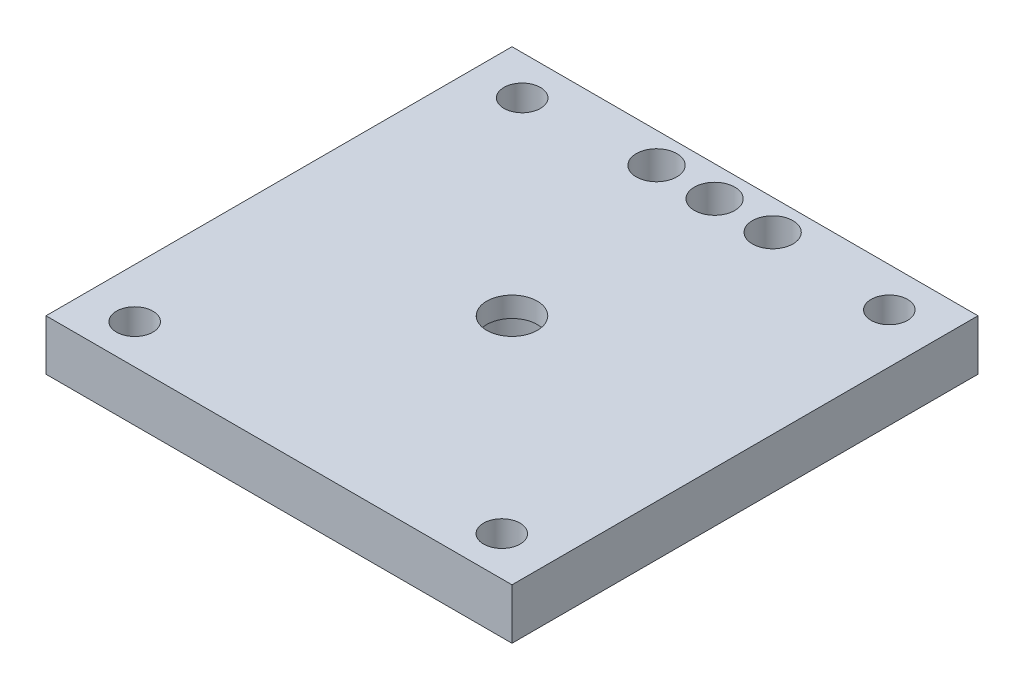
ISO-10303-21;
HEADER;
FILE_DESCRIPTION(('STEP AP214'),'2;1');
FILE_NAME('part.step','',(''),(''),'','','');
FILE_SCHEMA(('AUTOMOTIVE_DESIGN { 1 0 10303 214 1 1 1 1 }'));
ENDSEC;
DATA;
#1=APPLICATION_CONTEXT('core data for automotive mechanical design processes');
#2=APPLICATION_PROTOCOL_DEFINITION('international standard','automotive_design',2000,#1);
#3=PRODUCT_CONTEXT('',#1,'mechanical');
#4=PRODUCT('Part','Part','',(#3));
#5=PRODUCT_RELATED_PRODUCT_CATEGORY('part','',(#4));
#6=PRODUCT_DEFINITION_FORMATION('','',#4);
#7=PRODUCT_DEFINITION_CONTEXT('part definition',#1,'design');
#8=PRODUCT_DEFINITION('design','',#6,#7);
#9=PRODUCT_DEFINITION_SHAPE('','',#8);
#10=(LENGTH_UNIT() NAMED_UNIT(*) SI_UNIT(.MILLI.,.METRE.));
#11=(NAMED_UNIT(*) PLANE_ANGLE_UNIT() SI_UNIT($,.RADIAN.));
#12=(NAMED_UNIT(*) SI_UNIT($,.STERADIAN.) SOLID_ANGLE_UNIT());
#13=UNCERTAINTY_MEASURE_WITH_UNIT(LENGTH_MEASURE(1.E-05),#10,'distance_accuracy_value','');
#14=(GEOMETRIC_REPRESENTATION_CONTEXT(3) GLOBAL_UNCERTAINTY_ASSIGNED_CONTEXT((#13)) GLOBAL_UNIT_ASSIGNED_CONTEXT((#10,
#11,#12)) REPRESENTATION_CONTEXT('',''));
#15=CARTESIAN_POINT('',(0.,0.,0.));
#16=DIRECTION('',(0.,0.,1.));
#17=DIRECTION('',(1.,0.,0.));
#18=AXIS2_PLACEMENT_3D('',#15,#16,#17);
#19=CARTESIAN_POINT('',(23.,5.,-23.));
#20=DIRECTION('',(-1.,0.,0.));
#21=DIRECTION('',(0.,0.,1.));
#22=AXIS2_PLACEMENT_3D('',#19,#20,#21);
#23=PLANE('',#22);
#24=DIRECTION('',(0.,0.,-1.));
#25=VECTOR('',#24,1.);
#26=CARTESIAN_POINT('',(23.,0.,-23.));
#27=LINE('',#26,#25);
#28=CARTESIAN_POINT('',(23.,0.,23.));
#29=VERTEX_POINT('',#28);
#30=CARTESIAN_POINT('',(23.,0.,-23.));
#31=VERTEX_POINT('',#30);
#32=EDGE_CURVE('E227',#29,#31,#27,.T.);
#33=ORIENTED_EDGE('',*,*,#32,.T.);
#34=DIRECTION('',(0.,-1.,0.));
#35=VECTOR('',#34,1.);
#36=CARTESIAN_POINT('',(23.,5.,-23.));
#37=LINE('',#36,#35);
#38=CARTESIAN_POINT('',(23.,5.,-23.));
#39=VERTEX_POINT('',#38);
#40=EDGE_CURVE('E11',#39,#31,#37,.T.);
#41=ORIENTED_EDGE('',*,*,#40,.F.);
#42=DIRECTION('',(0.,0.,-1.));
#43=VECTOR('',#42,1.);
#44=CARTESIAN_POINT('',(23.,5.,-23.));
#45=LINE('',#44,#43);
#46=CARTESIAN_POINT('',(23.,5.,23.));
#47=VERTEX_POINT('',#46);
#48=EDGE_CURVE('E230',#47,#39,#45,.T.);
#49=ORIENTED_EDGE('',*,*,#48,.F.);
#50=DIRECTION('',(0.,-1.,0.));
#51=VECTOR('',#50,1.);
#52=CARTESIAN_POINT('',(23.,5.,23.));
#53=LINE('',#52,#51);
#54=EDGE_CURVE('E240',#47,#29,#53,.T.);
#55=ORIENTED_EDGE('',*,*,#54,.T.);
#56=EDGE_LOOP('',(#33,#41,#49,#55));
#57=FACE_BOUND('',#56,.T.);
#58=ADVANCED_FACE('F33',(#57),#23,.F.);
#59=CARTESIAN_POINT('',(-23.,5.,-23.));
#60=DIRECTION('',(0.,0.,1.));
#61=DIRECTION('',(1.,0.,0.));
#62=AXIS2_PLACEMENT_3D('',#59,#60,#61);
#63=PLANE('',#62);
#64=DIRECTION('',(-1.,0.,0.));
#65=VECTOR('',#64,1.);
#66=CARTESIAN_POINT('',(-23.,0.,-23.));
#67=LINE('',#66,#65);
#68=CARTESIAN_POINT('',(-23.,0.,-23.));
#69=VERTEX_POINT('',#68);
#70=EDGE_CURVE('E243',#31,#69,#67,.T.);
#71=ORIENTED_EDGE('',*,*,#70,.T.);
#72=DIRECTION('',(0.,-1.,0.));
#73=VECTOR('',#72,1.);
#74=CARTESIAN_POINT('',(-23.,5.,-23.));
#75=LINE('',#74,#73);
#76=CARTESIAN_POINT('',(-23.,5.,-23.));
#77=VERTEX_POINT('',#76);
#78=EDGE_CURVE('E41',#77,#69,#75,.T.);
#79=ORIENTED_EDGE('',*,*,#78,.F.);
#80=DIRECTION('',(-1.,0.,0.));
#81=VECTOR('',#80,1.);
#82=CARTESIAN_POINT('',(-23.,5.,-23.));
#83=LINE('',#82,#81);
#84=EDGE_CURVE('E233',#39,#77,#83,.T.);
#85=ORIENTED_EDGE('',*,*,#84,.F.);
#86=ORIENTED_EDGE('',*,*,#40,.T.);
#87=EDGE_LOOP('',(#71,#79,#85,#86));
#88=FACE_BOUND('',#87,.T.);
#89=ADVANCED_FACE('F274',(#88),#63,.F.);
#90=CARTESIAN_POINT('',(-23.,5.,-23.));
#91=DIRECTION('',(1.,0.,0.));
#92=DIRECTION('',(0.,0.,-1.));
#93=AXIS2_PLACEMENT_3D('',#90,#91,#92);
#94=PLANE('',#93);
#95=DIRECTION('',(0.,0.,1.));
#96=VECTOR('',#95,1.);
#97=CARTESIAN_POINT('',(-23.,0.,-23.));
#98=LINE('',#97,#96);
#99=CARTESIAN_POINT('',(-23.,0.,23.));
#100=VERTEX_POINT('',#99);
#101=EDGE_CURVE('E245',#69,#100,#98,.T.);
#102=ORIENTED_EDGE('',*,*,#101,.T.);
#103=DIRECTION('',(0.,-1.,0.));
#104=VECTOR('',#103,1.);
#105=CARTESIAN_POINT('',(-23.,5.,23.));
#106=LINE('',#105,#104);
#107=CARTESIAN_POINT('',(-23.,5.,23.));
#108=VERTEX_POINT('',#107);
#109=EDGE_CURVE('E250',#108,#100,#106,.T.);
#110=ORIENTED_EDGE('',*,*,#109,.F.);
#111=DIRECTION('',(0.,0.,1.));
#112=VECTOR('',#111,1.);
#113=CARTESIAN_POINT('',(-23.,5.,-23.));
#114=LINE('',#113,#112);
#115=EDGE_CURVE('E236',#77,#108,#114,.T.);
#116=ORIENTED_EDGE('',*,*,#115,.F.);
#117=ORIENTED_EDGE('',*,*,#78,.T.);
#118=EDGE_LOOP('',(#102,#110,#116,#117));
#119=FACE_BOUND('',#118,.T.);
#120=ADVANCED_FACE('F258',(#119),#94,.F.);
#121=CARTESIAN_POINT('',(-23.,5.,23.));
#122=DIRECTION('',(0.,0.,-1.));
#123=DIRECTION('',(-1.,0.,0.));
#124=AXIS2_PLACEMENT_3D('',#121,#122,#123);
#125=PLANE('',#124);
#126=DIRECTION('',(1.,0.,0.));
#127=VECTOR('',#126,1.);
#128=CARTESIAN_POINT('',(-23.,0.,23.));
#129=LINE('',#128,#127);
#130=EDGE_CURVE('E234',#100,#29,#129,.T.);
#131=ORIENTED_EDGE('',*,*,#130,.T.);
#132=ORIENTED_EDGE('',*,*,#54,.F.);
#133=DIRECTION('',(1.,0.,0.));
#134=VECTOR('',#133,1.);
#135=CARTESIAN_POINT('',(-23.,5.,23.));
#136=LINE('',#135,#134);
#137=EDGE_CURVE('E238',#108,#47,#136,.T.);
#138=ORIENTED_EDGE('',*,*,#137,.F.);
#139=ORIENTED_EDGE('',*,*,#109,.T.);
#140=EDGE_LOOP('',(#131,#132,#138,#139));
#141=FACE_BOUND('',#140,.T.);
#142=ADVANCED_FACE('F267',(#141),#125,.F.);
#143=CARTESIAN_POINT('',(0.,5.,0.));
#144=DIRECTION('',(0.,1.,0.));
#145=DIRECTION('',(0.,0.,1.));
#146=AXIS2_PLACEMENT_3D('',#143,#144,#145);
#147=PLANE('',#146);
#148=CARTESIAN_POINT('',(-5.733002600256,5.,-20.));
#149=DIRECTION('',(0.,1.,0.));
#150=DIRECTION('',(0.,0.,1.));
#151=AXIS2_PLACEMENT_3D('',#148,#149,#150);
#152=CIRCLE('',#151,2.);
#153=CARTESIAN_POINT('',(-5.733002600256,5.,-18.));
#154=VERTEX_POINT('',#153);
#155=EDGE_CURVE('E159',#154,#154,#152,.T.);
#156=ORIENTED_EDGE('',*,*,#155,.F.);
#157=EDGE_LOOP('',(#156));
#158=FACE_BOUND('',#157,.T.);
#159=CARTESIAN_POINT('',(5.73,5.,-20.));
#160=DIRECTION('',(0.,1.,0.));
#161=DIRECTION('',(0.,0.,1.));
#162=AXIS2_PLACEMENT_3D('',#159,#160,#161);
#163=CIRCLE('',#162,2.);
#164=CARTESIAN_POINT('',(5.73,5.,-18.));
#165=VERTEX_POINT('',#164);
#166=EDGE_CURVE('E369',#165,#165,#163,.T.);
#167=ORIENTED_EDGE('',*,*,#166,.F.);
#168=EDGE_LOOP('',(#167));
#169=FACE_BOUND('',#168,.T.);
#170=CARTESIAN_POINT('',(0.,5.,-20.));
#171=DIRECTION('',(0.,1.,0.));
#172=DIRECTION('',(0.,0.,1.));
#173=AXIS2_PLACEMENT_3D('',#170,#171,#172);
#174=CIRCLE('',#173,2.);
#175=CARTESIAN_POINT('',(0.,5.,-18.));
#176=VERTEX_POINT('',#175);
#177=EDGE_CURVE('E377',#176,#176,#174,.T.);
#178=ORIENTED_EDGE('',*,*,#177,.F.);
#179=EDGE_LOOP('',(#178));
#180=FACE_BOUND('',#179,.T.);
#181=CARTESIAN_POINT('',(0.,5.,0.));
#182=DIRECTION('',(0.,1.,0.));
#183=DIRECTION('',(0.,0.,1.));
#184=AXIS2_PLACEMENT_3D('',#181,#182,#183);
#185=CIRCLE('',#184,2.5);
#186=CARTESIAN_POINT('',(0.,5.,2.5));
#187=VERTEX_POINT('',#186);
#188=EDGE_CURVE('E221',#187,#187,#185,.T.);
#189=ORIENTED_EDGE('',*,*,#188,.F.);
#190=EDGE_LOOP('',(#189));
#191=FACE_BOUND('',#190,.T.);
#192=CARTESIAN_POINT('',(-18.12,5.,19.125));
#193=DIRECTION('',(0.,1.,0.));
#194=DIRECTION('',(0.,0.,1.));
#195=AXIS2_PLACEMENT_3D('',#192,#193,#194);
#196=CIRCLE('',#195,1.8);
#197=CARTESIAN_POINT('',(-18.12,5.,20.925));
#198=VERTEX_POINT('',#197);
#199=EDGE_CURVE('E215',#198,#198,#196,.T.);
#200=ORIENTED_EDGE('',*,*,#199,.F.);
#201=EDGE_LOOP('',(#200));
#202=FACE_BOUND('',#201,.T.);
#203=CARTESIAN_POINT('',(18.12,5.,19.125));
#204=DIRECTION('',(0.,1.,0.));
#205=DIRECTION('',(0.,0.,1.));
#206=AXIS2_PLACEMENT_3D('',#203,#204,#205);
#207=CIRCLE('',#206,1.8);
#208=CARTESIAN_POINT('',(18.12,5.,20.925));
#209=VERTEX_POINT('',#208);
#210=EDGE_CURVE('E209',#209,#209,#207,.T.);
#211=ORIENTED_EDGE('',*,*,#210,.F.);
#212=EDGE_LOOP('',(#211));
#213=FACE_BOUND('',#212,.T.);
#214=CARTESIAN_POINT('',(18.12,5.,-19.125));
#215=DIRECTION('',(0.,1.,0.));
#216=DIRECTION('',(0.,0.,1.));
#217=AXIS2_PLACEMENT_3D('',#214,#215,#216);
#218=CIRCLE('',#217,1.8);
#219=CARTESIAN_POINT('',(18.12,5.,-17.325));
#220=VERTEX_POINT('',#219);
#221=EDGE_CURVE('E202',#220,#220,#218,.T.);
#222=ORIENTED_EDGE('',*,*,#221,.F.);
#223=EDGE_LOOP('',(#222));
#224=FACE_BOUND('',#223,.T.);
#225=CARTESIAN_POINT('',(-18.12,5.,-19.125));
#226=DIRECTION('',(0.,1.,0.));
#227=DIRECTION('',(0.,0.,1.));
#228=AXIS2_PLACEMENT_3D('',#225,#226,#227);
#229=CIRCLE('',#228,1.8);
#230=CARTESIAN_POINT('',(-18.12,5.,-17.325));
#231=VERTEX_POINT('',#230);
#232=EDGE_CURVE('E224',#231,#231,#229,.T.);
#233=ORIENTED_EDGE('',*,*,#232,.F.);
#234=EDGE_LOOP('',(#233));
#235=FACE_BOUND('',#234,.T.);
#236=ORIENTED_EDGE('',*,*,#48,.T.);
#237=ORIENTED_EDGE('',*,*,#84,.T.);
#238=ORIENTED_EDGE('',*,*,#115,.T.);
#239=ORIENTED_EDGE('',*,*,#137,.T.);
#240=EDGE_LOOP('',(#236,#237,#238,#239));
#241=FACE_BOUND('',#240,.T.);
#242=ADVANCED_FACE('F273',(#158,#169,#180,#191,#202,#213,#224,#235,#241),#147,.T.);
#243=CARTESIAN_POINT('',(0.,0.,0.));
#244=DIRECTION('',(0.,1.,0.));
#245=DIRECTION('',(0.,0.,1.));
#246=AXIS2_PLACEMENT_3D('',#243,#244,#245);
#247=PLANE('',#246);
#248=CARTESIAN_POINT('',(-5.733002600256,0.,-20.));
#249=DIRECTION('',(0.,1.,0.));
#250=DIRECTION('',(0.,0.,1.));
#251=AXIS2_PLACEMENT_3D('',#248,#249,#250);
#252=CIRCLE('',#251,2.);
#253=CARTESIAN_POINT('',(-5.733002600256,0.,-18.));
#254=VERTEX_POINT('',#253);
#255=EDGE_CURVE('E368',#254,#254,#252,.T.);
#256=ORIENTED_EDGE('',*,*,#255,.T.);
#257=EDGE_LOOP('',(#256));
#258=FACE_BOUND('',#257,.T.);
#259=CARTESIAN_POINT('',(5.73,0.,-20.));
#260=DIRECTION('',(0.,1.,0.));
#261=DIRECTION('',(0.,0.,1.));
#262=AXIS2_PLACEMENT_3D('',#259,#260,#261);
#263=CIRCLE('',#262,2.);
#264=CARTESIAN_POINT('',(5.73,0.,-18.));
#265=VERTEX_POINT('',#264);
#266=EDGE_CURVE('E373',#265,#265,#263,.T.);
#267=ORIENTED_EDGE('',*,*,#266,.T.);
#268=EDGE_LOOP('',(#267));
#269=FACE_BOUND('',#268,.T.);
#270=CARTESIAN_POINT('',(0.,0.,-20.));
#271=DIRECTION('',(0.,1.,0.));
#272=DIRECTION('',(0.,0.,1.));
#273=AXIS2_PLACEMENT_3D('',#270,#271,#272);
#274=CIRCLE('',#273,2.);
#275=CARTESIAN_POINT('',(0.,0.,-18.));
#276=VERTEX_POINT('',#275);
#277=EDGE_CURVE('E152',#276,#276,#274,.T.);
#278=ORIENTED_EDGE('',*,*,#277,.T.);
#279=EDGE_LOOP('',(#278));
#280=FACE_BOUND('',#279,.T.);
#281=DIRECTION('',(1.,0.,0.));
#282=VECTOR('',#281,1.);
#283=CARTESIAN_POINT('',(3.86237656280875,0.,6.93972722617175));
#284=LINE('',#283,#282);
#285=CARTESIAN_POINT('',(3.86237656280875,0.,6.93972722617175));
#286=VERTEX_POINT('',#285);
#287=CARTESIAN_POINT('',(7.86237656280875,0.,6.93972722617175));
#288=VERTEX_POINT('',#287);
#289=EDGE_CURVE('E147',#286,#288,#284,.T.);
#290=ORIENTED_EDGE('',*,*,#289,.T.);
#291=DIRECTION('',(0.,0.,-1.));
#292=VECTOR('',#291,1.);
#293=CARTESIAN_POINT('',(7.86237656280875,0.,2.93972722617175));
#294=LINE('',#293,#292);
#295=CARTESIAN_POINT('',(7.86237656280875,0.,2.93972722617175));
#296=VERTEX_POINT('',#295);
#297=EDGE_CURVE('E157',#288,#296,#294,.T.);
#298=ORIENTED_EDGE('',*,*,#297,.T.);
#299=DIRECTION('',(-1.,0.,0.));
#300=VECTOR('',#299,1.);
#301=CARTESIAN_POINT('',(3.86237656280875,0.,2.93972722617175));
#302=LINE('',#301,#300);
#303=CARTESIAN_POINT('',(3.86237656280875,0.,2.93972722617175));
#304=VERTEX_POINT('',#303);
#305=EDGE_CURVE('E127',#296,#304,#302,.T.);
#306=ORIENTED_EDGE('',*,*,#305,.T.);
#307=DIRECTION('',(0.,0.,1.));
#308=VECTOR('',#307,1.);
#309=CARTESIAN_POINT('',(3.86237656280875,0.,2.93972722617175));
#310=LINE('',#309,#308);
#311=EDGE_CURVE('E48',#304,#286,#310,.T.);
#312=ORIENTED_EDGE('',*,*,#311,.T.);
#313=EDGE_LOOP('',(#290,#298,#306,#312));
#314=FACE_BOUND('',#313,.T.);
#315=DIRECTION('',(-1.,0.,0.));
#316=VECTOR('',#315,1.);
#317=CARTESIAN_POINT('',(-3.733002600256,0.,-7.06948708015753));
#318=LINE('',#317,#316);
#319=CARTESIAN_POINT('',(-3.733002600256,0.,-7.06948708015753));
#320=VERTEX_POINT('',#319);
#321=CARTESIAN_POINT('',(-7.733002600256,0.,-7.06948708015753));
#322=VERTEX_POINT('',#321);
#323=EDGE_CURVE('E171',#320,#322,#318,.T.);
#324=ORIENTED_EDGE('',*,*,#323,.T.);
#325=DIRECTION('',(0.,0.,1.));
#326=VECTOR('',#325,1.);
#327=CARTESIAN_POINT('',(-7.733002600256,0.,-7.06948708015753));
#328=LINE('',#327,#326);
#329=CARTESIAN_POINT('',(-7.733002600256,0.,-3.06948708015753));
#330=VERTEX_POINT('',#329);
#331=EDGE_CURVE('E163',#322,#330,#328,.T.);
#332=ORIENTED_EDGE('',*,*,#331,.T.);
#333=DIRECTION('',(1.,0.,0.));
#334=VECTOR('',#333,1.);
#335=CARTESIAN_POINT('',(-3.733002600256,0.,-3.06948708015753));
#336=LINE('',#335,#334);
#337=CARTESIAN_POINT('',(-3.733002600256,0.,-3.06948708015753));
#338=VERTEX_POINT('',#337);
#339=EDGE_CURVE('E183',#330,#338,#336,.T.);
#340=ORIENTED_EDGE('',*,*,#339,.T.);
#341=DIRECTION('',(0.,0.,-1.));
#342=VECTOR('',#341,1.);
#343=CARTESIAN_POINT('',(-3.733002600256,0.,-7.06948708015753));
#344=LINE('',#343,#342);
#345=EDGE_CURVE('E56',#338,#320,#344,.T.);
#346=ORIENTED_EDGE('',*,*,#345,.T.);
#347=EDGE_LOOP('',(#324,#332,#340,#346));
#348=FACE_BOUND('',#347,.T.);
#349=CARTESIAN_POINT('',(0.,0.,0.));
#350=DIRECTION('',(0.,1.,0.));
#351=DIRECTION('',(0.,0.,1.));
#352=AXIS2_PLACEMENT_3D('',#349,#350,#351);
#353=CIRCLE('',#352,4.1);
#354=CARTESIAN_POINT('',(0.,0.,4.1));
#355=VERTEX_POINT('',#354);
#356=EDGE_CURVE('E191',#355,#355,#353,.T.);
#357=ORIENTED_EDGE('',*,*,#356,.T.);
#358=EDGE_LOOP('',(#357));
#359=FACE_BOUND('',#358,.T.);
#360=CARTESIAN_POINT('',(-18.12,0.,19.125));
#361=DIRECTION('',(0.,1.,0.));
#362=DIRECTION('',(0.,0.,1.));
#363=AXIS2_PLACEMENT_3D('',#360,#361,#362);
#364=CIRCLE('',#363,1.8);
#365=CARTESIAN_POINT('',(-18.12,0.,20.925));
#366=VERTEX_POINT('',#365);
#367=EDGE_CURVE('E218',#366,#366,#364,.T.);
#368=ORIENTED_EDGE('',*,*,#367,.T.);
#369=EDGE_LOOP('',(#368));
#370=FACE_BOUND('',#369,.T.);
#371=CARTESIAN_POINT('',(18.12,0.,19.125));
#372=DIRECTION('',(0.,1.,0.));
#373=DIRECTION('',(0.,0.,1.));
#374=AXIS2_PLACEMENT_3D('',#371,#372,#373);
#375=CIRCLE('',#374,1.8);
#376=CARTESIAN_POINT('',(18.12,0.,20.925));
#377=VERTEX_POINT('',#376);
#378=EDGE_CURVE('E212',#377,#377,#375,.T.);
#379=ORIENTED_EDGE('',*,*,#378,.T.);
#380=EDGE_LOOP('',(#379));
#381=FACE_BOUND('',#380,.T.);
#382=CARTESIAN_POINT('',(18.12,0.,-19.125));
#383=DIRECTION('',(0.,1.,0.));
#384=DIRECTION('',(0.,0.,1.));
#385=AXIS2_PLACEMENT_3D('',#382,#383,#384);
#386=CIRCLE('',#385,1.8);
#387=CARTESIAN_POINT('',(18.12,0.,-17.325));
#388=VERTEX_POINT('',#387);
#389=EDGE_CURVE('E206',#388,#388,#386,.T.);
#390=ORIENTED_EDGE('',*,*,#389,.T.);
#391=EDGE_LOOP('',(#390));
#392=FACE_BOUND('',#391,.T.);
#393=CARTESIAN_POINT('',(-18.12,0.,-19.125));
#394=DIRECTION('',(0.,1.,0.));
#395=DIRECTION('',(0.,0.,1.));
#396=AXIS2_PLACEMENT_3D('',#393,#394,#395);
#397=CIRCLE('',#396,1.8);
#398=CARTESIAN_POINT('',(-18.12,0.,-17.325));
#399=VERTEX_POINT('',#398);
#400=EDGE_CURVE('E205',#399,#399,#397,.T.);
#401=ORIENTED_EDGE('',*,*,#400,.T.);
#402=EDGE_LOOP('',(#401));
#403=FACE_BOUND('',#402,.T.);
#404=ORIENTED_EDGE('',*,*,#32,.F.);
#405=ORIENTED_EDGE('',*,*,#130,.F.);
#406=ORIENTED_EDGE('',*,*,#101,.F.);
#407=ORIENTED_EDGE('',*,*,#70,.F.);
#408=EDGE_LOOP('',(#404,#405,#406,#407));
#409=FACE_BOUND('',#408,.T.);
#410=ADVANCED_FACE('F264',(#258,#269,#280,#314,#348,#359,#370,#381,#392,#403,#409),#247,.F.);
#411=CARTESIAN_POINT('',(-18.12,5.,-19.125));
#412=DIRECTION('',(0.,-1.,0.));
#413=DIRECTION('',(0.,0.,-1.));
#414=AXIS2_PLACEMENT_3D('',#411,#412,#413);
#415=CYLINDRICAL_SURFACE('',#414,1.8);
#416=ORIENTED_EDGE('',*,*,#232,.T.);
#417=EDGE_LOOP('',(#416));
#418=FACE_BOUND('',#417,.T.);
#419=ORIENTED_EDGE('',*,*,#400,.F.);
#420=EDGE_LOOP('',(#419));
#421=FACE_BOUND('',#420,.T.);
#422=ADVANCED_FACE('F286',(#418,#421),#415,.F.);
#423=CARTESIAN_POINT('',(18.12,5.,-19.125));
#424=DIRECTION('',(0.,-1.,0.));
#425=DIRECTION('',(0.,0.,-1.));
#426=AXIS2_PLACEMENT_3D('',#423,#424,#425);
#427=CYLINDRICAL_SURFACE('',#426,1.8);
#428=ORIENTED_EDGE('',*,*,#221,.T.);
#429=EDGE_LOOP('',(#428));
#430=FACE_BOUND('',#429,.T.);
#431=ORIENTED_EDGE('',*,*,#389,.F.);
#432=EDGE_LOOP('',(#431));
#433=FACE_BOUND('',#432,.T.);
#434=ADVANCED_FACE('F293',(#430,#433),#427,.F.);
#435=CARTESIAN_POINT('',(18.12,5.,19.125));
#436=DIRECTION('',(0.,-1.,0.));
#437=DIRECTION('',(0.,0.,-1.));
#438=AXIS2_PLACEMENT_3D('',#435,#436,#437);
#439=CYLINDRICAL_SURFACE('',#438,1.8);
#440=ORIENTED_EDGE('',*,*,#210,.T.);
#441=EDGE_LOOP('',(#440));
#442=FACE_BOUND('',#441,.T.);
#443=ORIENTED_EDGE('',*,*,#378,.F.);
#444=EDGE_LOOP('',(#443));
#445=FACE_BOUND('',#444,.T.);
#446=ADVANCED_FACE('F303',(#442,#445),#439,.F.);
#447=CARTESIAN_POINT('',(-18.12,5.,19.125));
#448=DIRECTION('',(0.,-1.,0.));
#449=DIRECTION('',(0.,0.,-1.));
#450=AXIS2_PLACEMENT_3D('',#447,#448,#449);
#451=CYLINDRICAL_SURFACE('',#450,1.8);
#452=ORIENTED_EDGE('',*,*,#199,.T.);
#453=EDGE_LOOP('',(#452));
#454=FACE_BOUND('',#453,.T.);
#455=ORIENTED_EDGE('',*,*,#367,.F.);
#456=EDGE_LOOP('',(#455));
#457=FACE_BOUND('',#456,.T.);
#458=ADVANCED_FACE('F299',(#454,#457),#451,.F.);
#459=CARTESIAN_POINT('',(0.,5.,0.));
#460=DIRECTION('',(0.,-1.,0.));
#461=DIRECTION('',(0.,0.,-1.));
#462=AXIS2_PLACEMENT_3D('',#459,#460,#461);
#463=CYLINDRICAL_SURFACE('',#462,2.5);
#464=CARTESIAN_POINT('',(0.,3.,0.));
#465=DIRECTION('',(0.,1.,0.));
#466=DIRECTION('',(0.,0.,1.));
#467=AXIS2_PLACEMENT_3D('',#464,#465,#466);
#468=CIRCLE('',#467,2.5);
#469=CARTESIAN_POINT('',(0.,3.,2.5));
#470=VERTEX_POINT('',#469);
#471=EDGE_CURVE('E36',#470,#470,#468,.T.);
#472=ORIENTED_EDGE('',*,*,#471,.F.);
#473=EDGE_LOOP('',(#472));
#474=FACE_BOUND('',#473,.T.);
#475=ORIENTED_EDGE('',*,*,#188,.T.);
#476=EDGE_LOOP('',(#475));
#477=FACE_BOUND('',#476,.T.);
#478=ADVANCED_FACE('F295',(#474,#477),#463,.F.);
#479=CARTESIAN_POINT('',(0.,3.,0.));
#480=DIRECTION('',(0.,-1.,0.));
#481=DIRECTION('',(0.,0.,-1.));
#482=AXIS2_PLACEMENT_3D('',#479,#480,#481);
#483=CYLINDRICAL_SURFACE('',#482,4.1);
#484=CARTESIAN_POINT('',(0.,3.,0.));
#485=DIRECTION('',(0.,1.,0.));
#486=DIRECTION('',(0.,0.,1.));
#487=AXIS2_PLACEMENT_3D('',#484,#485,#486);
#488=CIRCLE('',#487,4.1);
#489=CARTESIAN_POINT('',(0.,3.,4.1));
#490=VERTEX_POINT('',#489);
#491=EDGE_CURVE('E197',#490,#490,#488,.T.);
#492=ORIENTED_EDGE('',*,*,#491,.T.);
#493=EDGE_LOOP('',(#492));
#494=FACE_BOUND('',#493,.T.);
#495=ORIENTED_EDGE('',*,*,#356,.F.);
#496=EDGE_LOOP('',(#495));
#497=FACE_BOUND('',#496,.T.);
#498=ADVANCED_FACE('F298',(#494,#497),#483,.F.);
#499=CARTESIAN_POINT('',(0.,3.,0.));
#500=DIRECTION('',(0.,1.,0.));
#501=DIRECTION('',(0.,0.,1.));
#502=AXIS2_PLACEMENT_3D('',#499,#500,#501);
#503=PLANE('',#502);
#504=ORIENTED_EDGE('',*,*,#471,.T.);
#505=EDGE_LOOP('',(#504));
#506=FACE_BOUND('',#505,.T.);
#507=ORIENTED_EDGE('',*,*,#491,.F.);
#508=EDGE_LOOP('',(#507));
#509=FACE_BOUND('',#508,.T.);
#510=ADVANCED_FACE('F313',(#506,#509),#503,.F.);
#511=CARTESIAN_POINT('',(-7.733002600256,-3.,-7.06948708015753));
#512=DIRECTION('',(-1.,0.,0.));
#513=DIRECTION('',(0.,0.,1.));
#514=AXIS2_PLACEMENT_3D('',#511,#512,#513);
#515=PLANE('',#514);
#516=ORIENTED_EDGE('',*,*,#331,.F.);
#517=DIRECTION('',(0.,1.,0.));
#518=VECTOR('',#517,1.);
#519=CARTESIAN_POINT('',(-7.733002600256,-3.,-7.06948708015753));
#520=LINE('',#519,#518);
#521=CARTESIAN_POINT('',(-7.733002600256,-3.,-7.06948708015753));
#522=VERTEX_POINT('',#521);
#523=EDGE_CURVE('E189',#522,#322,#520,.T.);
#524=ORIENTED_EDGE('',*,*,#523,.F.);
#525=DIRECTION('',(0.,0.,1.));
#526=VECTOR('',#525,1.);
#527=CARTESIAN_POINT('',(-7.733002600256,-3.,-7.06948708015753));
#528=LINE('',#527,#526);
#529=CARTESIAN_POINT('',(-7.733002600256,-3.,-3.06948708015753));
#530=VERTEX_POINT('',#529);
#531=EDGE_CURVE('E167',#522,#530,#528,.T.);
#532=ORIENTED_EDGE('',*,*,#531,.T.);
#533=DIRECTION('',(0.,1.,0.));
#534=VECTOR('',#533,1.);
#535=CARTESIAN_POINT('',(-7.733002600256,-3.,-3.06948708015753));
#536=LINE('',#535,#534);
#537=EDGE_CURVE('E180',#530,#330,#536,.T.);
#538=ORIENTED_EDGE('',*,*,#537,.T.);
#539=EDGE_LOOP('',(#516,#524,#532,#538));
#540=FACE_BOUND('',#539,.T.);
#541=ADVANCED_FACE('F317',(#540),#515,.T.);
#542=CARTESIAN_POINT('',(-3.733002600256,-3.,-7.06948708015753));
#543=DIRECTION('',(0.,0.,-1.));
#544=DIRECTION('',(-1.,0.,0.));
#545=AXIS2_PLACEMENT_3D('',#542,#543,#544);
#546=PLANE('',#545);
#547=ORIENTED_EDGE('',*,*,#323,.F.);
#548=DIRECTION('',(0.,1.,0.));
#549=VECTOR('',#548,1.);
#550=CARTESIAN_POINT('',(-3.733002600256,-3.,-7.06948708015753));
#551=LINE('',#550,#549);
#552=CARTESIAN_POINT('',(-3.733002600256,-3.,-7.06948708015753));
#553=VERTEX_POINT('',#552);
#554=EDGE_CURVE('E192',#553,#320,#551,.T.);
#555=ORIENTED_EDGE('',*,*,#554,.F.);
#556=DIRECTION('',(-1.,0.,0.));
#557=VECTOR('',#556,1.);
#558=CARTESIAN_POINT('',(-3.733002600256,-3.,-7.06948708015753));
#559=LINE('',#558,#557);
#560=EDGE_CURVE('E177',#553,#522,#559,.T.);
#561=ORIENTED_EDGE('',*,*,#560,.T.);
#562=ORIENTED_EDGE('',*,*,#523,.T.);
#563=EDGE_LOOP('',(#547,#555,#561,#562));
#564=FACE_BOUND('',#563,.T.);
#565=ADVANCED_FACE('F321',(#564),#546,.T.);
#566=CARTESIAN_POINT('',(-3.733002600256,-3.,-7.06948708015753));
#567=DIRECTION('',(1.,0.,0.));
#568=DIRECTION('',(0.,0.,-1.));
#569=AXIS2_PLACEMENT_3D('',#566,#567,#568);
#570=PLANE('',#569);
#571=ORIENTED_EDGE('',*,*,#345,.F.);
#572=DIRECTION('',(0.,1.,0.));
#573=VECTOR('',#572,1.);
#574=CARTESIAN_POINT('',(-3.733002600256,-3.,-3.06948708015753));
#575=LINE('',#574,#573);
#576=CARTESIAN_POINT('',(-3.733002600256,-3.,-3.06948708015753));
#577=VERTEX_POINT('',#576);
#578=EDGE_CURVE('E194',#577,#338,#575,.T.);
#579=ORIENTED_EDGE('',*,*,#578,.F.);
#580=DIRECTION('',(0.,0.,-1.));
#581=VECTOR('',#580,1.);
#582=CARTESIAN_POINT('',(-3.733002600256,-3.,-7.06948708015753));
#583=LINE('',#582,#581);
#584=EDGE_CURVE('E174',#577,#553,#583,.T.);
#585=ORIENTED_EDGE('',*,*,#584,.T.);
#586=ORIENTED_EDGE('',*,*,#554,.T.);
#587=EDGE_LOOP('',(#571,#579,#585,#586));
#588=FACE_BOUND('',#587,.T.);
#589=ADVANCED_FACE('F327',(#588),#570,.T.);
#590=CARTESIAN_POINT('',(-3.733002600256,-3.,-3.06948708015753));
#591=DIRECTION('',(0.,0.,1.));
#592=DIRECTION('',(1.,0.,0.));
#593=AXIS2_PLACEMENT_3D('',#590,#591,#592);
#594=PLANE('',#593);
#595=ORIENTED_EDGE('',*,*,#339,.F.);
#596=ORIENTED_EDGE('',*,*,#537,.F.);
#597=DIRECTION('',(1.,0.,0.));
#598=VECTOR('',#597,1.);
#599=CARTESIAN_POINT('',(-3.733002600256,-3.,-3.06948708015753));
#600=LINE('',#599,#598);
#601=EDGE_CURVE('E170',#530,#577,#600,.T.);
#602=ORIENTED_EDGE('',*,*,#601,.T.);
#603=ORIENTED_EDGE('',*,*,#578,.T.);
#604=EDGE_LOOP('',(#595,#596,#602,#603));
#605=FACE_BOUND('',#604,.T.);
#606=ADVANCED_FACE('F323',(#605),#594,.T.);
#607=CARTESIAN_POINT('',(0.,-3.,0.));
#608=DIRECTION('',(0.,-1.,0.));
#609=DIRECTION('',(0.,0.,-1.));
#610=AXIS2_PLACEMENT_3D('',#607,#608,#609);
#611=PLANE('',#610);
#612=ORIENTED_EDGE('',*,*,#531,.F.);
#613=ORIENTED_EDGE('',*,*,#560,.F.);
#614=ORIENTED_EDGE('',*,*,#584,.F.);
#615=ORIENTED_EDGE('',*,*,#601,.F.);
#616=EDGE_LOOP('',(#612,#613,#614,#615));
#617=FACE_BOUND('',#616,.T.);
#618=ADVANCED_FACE('F326',(#617),#611,.T.);
#619=CARTESIAN_POINT('',(7.86237656280875,-3.,2.93972722617175));
#620=DIRECTION('',(1.,0.,0.));
#621=DIRECTION('',(0.,0.,-1.));
#622=AXIS2_PLACEMENT_3D('',#619,#620,#621);
#623=PLANE('',#622);
#624=ORIENTED_EDGE('',*,*,#297,.F.);
#625=DIRECTION('',(0.,1.,0.));
#626=VECTOR('',#625,1.);
#627=CARTESIAN_POINT('',(7.86237656280875,-3.,6.93972722617175));
#628=LINE('',#627,#626);
#629=CARTESIAN_POINT('',(7.86237656280875,-3.,6.93972722617175));
#630=VERTEX_POINT('',#629);
#631=EDGE_CURVE('E146',#630,#288,#628,.T.);
#632=ORIENTED_EDGE('',*,*,#631,.F.);
#633=DIRECTION('',(0.,0.,-1.));
#634=VECTOR('',#633,1.);
#635=CARTESIAN_POINT('',(7.86237656280875,-3.,2.93972722617175));
#636=LINE('',#635,#634);
#637=CARTESIAN_POINT('',(7.86237656280875,-3.,2.93972722617175));
#638=VERTEX_POINT('',#637);
#639=EDGE_CURVE('E140',#630,#638,#636,.T.);
#640=ORIENTED_EDGE('',*,*,#639,.T.);
#641=DIRECTION('',(0.,1.,0.));
#642=VECTOR('',#641,1.);
#643=CARTESIAN_POINT('',(7.86237656280875,-3.,2.93972722617175));
#644=LINE('',#643,#642);
#645=EDGE_CURVE('E122',#638,#296,#644,.T.);
#646=ORIENTED_EDGE('',*,*,#645,.T.);
#647=EDGE_LOOP('',(#624,#632,#640,#646));
#648=FACE_BOUND('',#647,.T.);
#649=ADVANCED_FACE('F145',(#648),#623,.T.);
#650=CARTESIAN_POINT('',(3.86237656280875,-3.,6.93972722617175));
#651=DIRECTION('',(0.,0.,1.));
#652=DIRECTION('',(1.,0.,0.));
#653=AXIS2_PLACEMENT_3D('',#650,#651,#652);
#654=PLANE('',#653);
#655=ORIENTED_EDGE('',*,*,#289,.F.);
#656=DIRECTION('',(0.,1.,0.));
#657=VECTOR('',#656,1.);
#658=CARTESIAN_POINT('',(3.86237656280875,-3.,6.93972722617175));
#659=LINE('',#658,#657);
#660=CARTESIAN_POINT('',(3.86237656280875,-3.,6.93972722617175));
#661=VERTEX_POINT('',#660);
#662=EDGE_CURVE('E164',#661,#286,#659,.T.);
#663=ORIENTED_EDGE('',*,*,#662,.F.);
#664=DIRECTION('',(1.,0.,0.));
#665=VECTOR('',#664,1.);
#666=CARTESIAN_POINT('',(3.86237656280875,-3.,6.93972722617175));
#667=LINE('',#666,#665);
#668=EDGE_CURVE('E133',#661,#630,#667,.T.);
#669=ORIENTED_EDGE('',*,*,#668,.T.);
#670=ORIENTED_EDGE('',*,*,#631,.T.);
#671=EDGE_LOOP('',(#655,#663,#669,#670));
#672=FACE_BOUND('',#671,.T.);
#673=ADVANCED_FACE('F339',(#672),#654,.T.);
#674=CARTESIAN_POINT('',(3.86237656280875,-3.,2.93972722617175));
#675=DIRECTION('',(-1.,0.,0.));
#676=DIRECTION('',(0.,0.,1.));
#677=AXIS2_PLACEMENT_3D('',#674,#675,#676);
#678=PLANE('',#677);
#679=ORIENTED_EDGE('',*,*,#311,.F.);
#680=DIRECTION('',(0.,1.,0.));
#681=VECTOR('',#680,1.);
#682=CARTESIAN_POINT('',(3.86237656280875,-3.,2.93972722617175));
#683=LINE('',#682,#681);
#684=CARTESIAN_POINT('',(3.86237656280875,-3.,2.93972722617175));
#685=VERTEX_POINT('',#684);
#686=EDGE_CURVE('E132',#685,#304,#683,.T.);
#687=ORIENTED_EDGE('',*,*,#686,.F.);
#688=DIRECTION('',(0.,0.,1.));
#689=VECTOR('',#688,1.);
#690=CARTESIAN_POINT('',(3.86237656280875,-3.,2.93972722617175));
#691=LINE('',#690,#689);
#692=EDGE_CURVE('E143',#685,#661,#691,.T.);
#693=ORIENTED_EDGE('',*,*,#692,.T.);
#694=ORIENTED_EDGE('',*,*,#662,.T.);
#695=EDGE_LOOP('',(#679,#687,#693,#694));
#696=FACE_BOUND('',#695,.T.);
#697=ADVANCED_FACE('F342',(#696),#678,.T.);
#698=CARTESIAN_POINT('',(3.86237656280875,-3.,2.93972722617175));
#699=DIRECTION('',(0.,0.,-1.));
#700=DIRECTION('',(-1.,0.,0.));
#701=AXIS2_PLACEMENT_3D('',#698,#699,#700);
#702=PLANE('',#701);
#703=ORIENTED_EDGE('',*,*,#305,.F.);
#704=ORIENTED_EDGE('',*,*,#645,.F.);
#705=DIRECTION('',(-1.,0.,0.));
#706=VECTOR('',#705,1.);
#707=CARTESIAN_POINT('',(3.86237656280875,-3.,2.93972722617175));
#708=LINE('',#707,#706);
#709=EDGE_CURVE('E125',#638,#685,#708,.T.);
#710=ORIENTED_EDGE('',*,*,#709,.T.);
#711=ORIENTED_EDGE('',*,*,#686,.T.);
#712=EDGE_LOOP('',(#703,#704,#710,#711));
#713=FACE_BOUND('',#712,.T.);
#714=ADVANCED_FACE('F124',(#713),#702,.T.);
#715=CARTESIAN_POINT('',(0.,-3.,0.));
#716=DIRECTION('',(0.,1.,0.));
#717=DIRECTION('',(0.,0.,1.));
#718=AXIS2_PLACEMENT_3D('',#715,#716,#717);
#719=PLANE('',#718);
#720=ORIENTED_EDGE('',*,*,#639,.F.);
#721=ORIENTED_EDGE('',*,*,#668,.F.);
#722=ORIENTED_EDGE('',*,*,#692,.F.);
#723=ORIENTED_EDGE('',*,*,#709,.F.);
#724=EDGE_LOOP('',(#720,#721,#722,#723));
#725=FACE_BOUND('',#724,.T.);
#726=ADVANCED_FACE('F138',(#725),#719,.F.);
#727=CARTESIAN_POINT('',(0.,5.,-20.));
#728=DIRECTION('',(0.,-1.,0.));
#729=DIRECTION('',(0.,0.,-1.));
#730=AXIS2_PLACEMENT_3D('',#727,#728,#729);
#731=CYLINDRICAL_SURFACE('',#730,2.);
#732=ORIENTED_EDGE('',*,*,#177,.T.);
#733=EDGE_LOOP('',(#732));
#734=FACE_BOUND('',#733,.T.);
#735=ORIENTED_EDGE('',*,*,#277,.F.);
#736=EDGE_LOOP('',(#735));
#737=FACE_BOUND('',#736,.T.);
#738=ADVANCED_FACE('F350',(#734,#737),#731,.F.);
#739=CARTESIAN_POINT('',(5.73,5.,-20.));
#740=DIRECTION('',(0.,-1.,0.));
#741=DIRECTION('',(0.,0.,-1.));
#742=AXIS2_PLACEMENT_3D('',#739,#740,#741);
#743=CYLINDRICAL_SURFACE('',#742,2.);
#744=ORIENTED_EDGE('',*,*,#166,.T.);
#745=EDGE_LOOP('',(#744));
#746=FACE_BOUND('',#745,.T.);
#747=ORIENTED_EDGE('',*,*,#266,.F.);
#748=EDGE_LOOP('',(#747));
#749=FACE_BOUND('',#748,.T.);
#750=ADVANCED_FACE('F353',(#746,#749),#743,.F.);
#751=CARTESIAN_POINT('',(-5.733002600256,5.,-20.));
#752=DIRECTION('',(0.,-1.,0.));
#753=DIRECTION('',(0.,0.,-1.));
#754=AXIS2_PLACEMENT_3D('',#751,#752,#753);
#755=CYLINDRICAL_SURFACE('',#754,2.);
#756=ORIENTED_EDGE('',*,*,#155,.T.);
#757=EDGE_LOOP('',(#756));
#758=FACE_BOUND('',#757,.T.);
#759=ORIENTED_EDGE('',*,*,#255,.F.);
#760=EDGE_LOOP('',(#759));
#761=FACE_BOUND('',#760,.T.);
#762=ADVANCED_FACE('F357',(#758,#761),#755,.F.);
#763=CLOSED_SHELL('',(#58,#89,#120,#142,#242,#410,#422,#434,#446,#458,#478,#498,#510,#541,#565,
#589,#606,#618,#649,#673,#697,#714,#726,#738,#750,#762));
#764=MANIFOLD_SOLID_BREP('B2',#763);
#765=ADVANCED_BREP_SHAPE_REPRESENTATION('',(#18,#764),#14);
#766=SHAPE_DEFINITION_REPRESENTATION(#9,#765);
ENDSEC;
END-ISO-10303-21;
